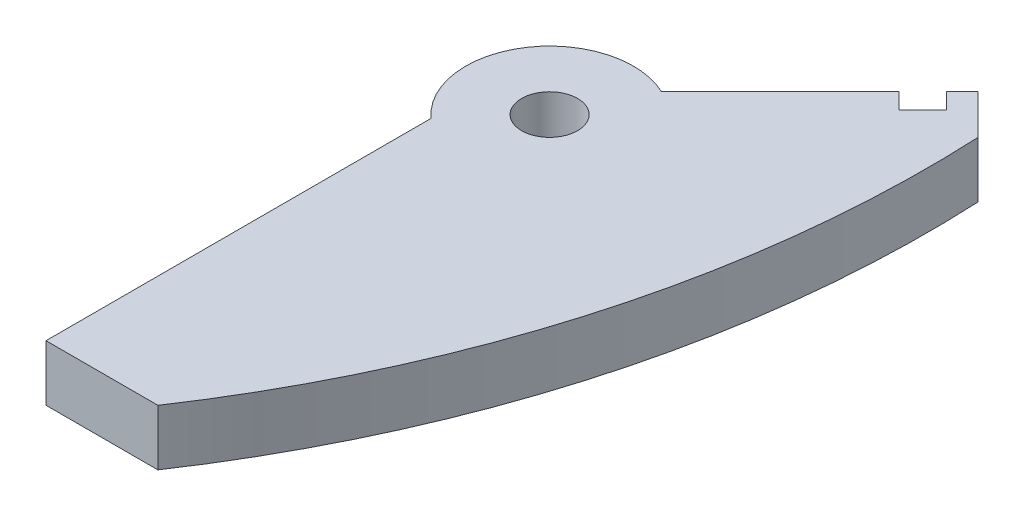
ISO-10303-21;
HEADER;
FILE_DESCRIPTION(('STEP AP214'),'2;1');
FILE_NAME('part.step','',(''),(''),'','','');
FILE_SCHEMA(('AUTOMOTIVE_DESIGN { 1 0 10303 214 1 1 1 1 }'));
ENDSEC;
DATA;
#1=APPLICATION_CONTEXT('core data for automotive mechanical design processes');
#2=APPLICATION_PROTOCOL_DEFINITION('international standard','automotive_design',2000,#1);
#3=PRODUCT_CONTEXT('',#1,'mechanical');
#4=PRODUCT('Part','Part','',(#3));
#5=PRODUCT_RELATED_PRODUCT_CATEGORY('part','',(#4));
#6=PRODUCT_DEFINITION_FORMATION('','',#4);
#7=PRODUCT_DEFINITION_CONTEXT('part definition',#1,'design');
#8=PRODUCT_DEFINITION('design','',#6,#7);
#9=PRODUCT_DEFINITION_SHAPE('','',#8);
#10=(LENGTH_UNIT() NAMED_UNIT(*) SI_UNIT(.MILLI.,.METRE.));
#11=(NAMED_UNIT(*) PLANE_ANGLE_UNIT() SI_UNIT($,.RADIAN.));
#12=(NAMED_UNIT(*) SI_UNIT($,.STERADIAN.) SOLID_ANGLE_UNIT());
#13=UNCERTAINTY_MEASURE_WITH_UNIT(LENGTH_MEASURE(1.E-05),#10,'distance_accuracy_value','');
#14=(GEOMETRIC_REPRESENTATION_CONTEXT(3) GLOBAL_UNCERTAINTY_ASSIGNED_CONTEXT((#13)) GLOBAL_UNIT_ASSIGNED_CONTEXT((#10,
#11,#12)) REPRESENTATION_CONTEXT('',''));
#15=CARTESIAN_POINT('',(0.,0.,0.));
#16=DIRECTION('',(0.,0.,1.));
#17=DIRECTION('',(1.,0.,0.));
#18=AXIS2_PLACEMENT_3D('',#15,#16,#17);
#19=CARTESIAN_POINT('',(0.,3.175,50.8));
#20=DIRECTION('',(0.,0.,1.));
#21=DIRECTION('',(1.,0.,0.));
#22=AXIS2_PLACEMENT_3D('',#19,#20,#21);
#23=PLANE('',#22);
#24=DIRECTION('',(-1.,0.,0.));
#25=VECTOR('',#24,1.);
#26=CARTESIAN_POINT('',(0.,-3.175,50.8));
#27=LINE('',#26,#25);
#28=CARTESIAN_POINT('',(6.35000000000001,-3.175,50.8));
#29=VERTEX_POINT('',#28);
#30=CARTESIAN_POINT('',(-6.34999999999999,-3.175,50.8));
#31=VERTEX_POINT('',#30);
#32=EDGE_CURVE('E161',#29,#31,#27,.T.);
#33=ORIENTED_EDGE('',*,*,#32,.F.);
#34=DIRECTION('',(0.,-1.,0.));
#35=VECTOR('',#34,1.);
#36=CARTESIAN_POINT('',(6.35000000000001,3.175,50.8));
#37=LINE('',#36,#35);
#38=CARTESIAN_POINT('',(6.35000000000001,3.175,50.8));
#39=VERTEX_POINT('',#38);
#40=EDGE_CURVE('E11',#39,#29,#37,.T.);
#41=ORIENTED_EDGE('',*,*,#40,.F.);
#42=DIRECTION('',(-1.,0.,0.));
#43=VECTOR('',#42,1.);
#44=CARTESIAN_POINT('',(0.,3.175,50.8));
#45=LINE('',#44,#43);
#46=CARTESIAN_POINT('',(-6.34999999999999,3.175,50.8));
#47=VERTEX_POINT('',#46);
#48=EDGE_CURVE('E198',#39,#47,#45,.T.);
#49=ORIENTED_EDGE('',*,*,#48,.T.);
#50=DIRECTION('',(0.,-1.,0.));
#51=VECTOR('',#50,1.);
#52=CARTESIAN_POINT('',(-6.34999999999999,3.175,50.8));
#53=LINE('',#52,#51);
#54=EDGE_CURVE('E102',#47,#31,#53,.T.);
#55=ORIENTED_EDGE('',*,*,#54,.T.);
#56=EDGE_LOOP('',(#33,#41,#49,#55));
#57=FACE_BOUND('',#56,.T.);
#58=ADVANCED_FACE('F45',(#57),#23,.T.);
#59=CARTESIAN_POINT('',(-93.915629925862,3.175,-16.2378674755811));
#60=DIRECTION('',(0.,-1.,0.));
#61=DIRECTION('',(0.,0.,-1.));
#62=AXIS2_PLACEMENT_3D('',#59,#60,#61);
#63=CYLINDRICAL_SURFACE('',#62,120.612073276698);
#64=CARTESIAN_POINT('',(-93.915629925862,-3.175,-16.2378674755811));
#65=DIRECTION('',(0.,1.,0.));
#66=DIRECTION('',(0.,0.,1.));
#67=AXIS2_PLACEMENT_3D('',#64,#65,#66);
#68=CIRCLE('',#67,120.612073276698);
#69=CARTESIAN_POINT('',(26.5555762724056,-3.175,-22.0654482118709));
#70=VERTEX_POINT('',#69);
#71=EDGE_CURVE('E165',#70,#29,#68,.F.);
#72=ORIENTED_EDGE('',*,*,#71,.F.);
#73=DIRECTION('',(0.,-1.,0.));
#74=VECTOR('',#73,1.);
#75=CARTESIAN_POINT('',(26.5555762724056,3.175,-22.0654482118709));
#76=LINE('',#75,#74);
#77=CARTESIAN_POINT('',(26.5555762724056,3.175,-22.0654482118709));
#78=VERTEX_POINT('',#77);
#79=EDGE_CURVE('E54',#78,#70,#76,.T.);
#80=ORIENTED_EDGE('',*,*,#79,.F.);
#81=CARTESIAN_POINT('',(-93.915629925862,3.175,-16.2378674755811));
#82=DIRECTION('',(0.,1.,0.));
#83=DIRECTION('',(0.,0.,1.));
#84=AXIS2_PLACEMENT_3D('',#81,#82,#83);
#85=CIRCLE('',#84,120.612073276698);
#86=EDGE_CURVE('E242',#78,#39,#85,.F.);
#87=ORIENTED_EDGE('',*,*,#86,.T.);
#88=ORIENTED_EDGE('',*,*,#40,.T.);
#89=EDGE_LOOP('',(#72,#80,#87,#88));
#90=FACE_BOUND('',#89,.T.);
#91=ADVANCED_FACE('F229',(#90),#63,.T.);
#92=CARTESIAN_POINT('',(24.3105122421384,3.175,-24.3105122421381));
#93=DIRECTION('',(0.707106781186551,0.,-0.707106781186544));
#94=DIRECTION('',(-0.707106781186544,0.,-0.707106781186551));
#95=AXIS2_PLACEMENT_3D('',#92,#93,#94);
#96=PLANE('',#95);
#97=DIRECTION('',(0.707106781186544,0.,0.707106781186551));
#98=VECTOR('',#97,1.);
#99=CARTESIAN_POINT('',(24.3105122421384,-3.175,-24.3105122421381));
#100=LINE('',#99,#98);
#101=CARTESIAN_POINT('',(22.065448211871,-3.175,-26.5555762724055));
#102=VERTEX_POINT('',#101);
#103=EDGE_CURVE('E169',#102,#70,#100,.T.);
#104=ORIENTED_EDGE('',*,*,#103,.F.);
#105=DIRECTION('',(0.,-1.,0.));
#106=VECTOR('',#105,1.);
#107=CARTESIAN_POINT('',(22.065448211871,3.175,-26.5555762724055));
#108=LINE('',#107,#106);
#109=CARTESIAN_POINT('',(22.065448211871,3.175,-26.5555762724055));
#110=VERTEX_POINT('',#109);
#111=EDGE_CURVE('E216',#110,#102,#108,.T.);
#112=ORIENTED_EDGE('',*,*,#111,.F.);
#113=DIRECTION('',(0.707106781186544,0.,0.707106781186551));
#114=VECTOR('',#113,1.);
#115=CARTESIAN_POINT('',(24.3105122421384,3.175,-24.3105122421381));
#116=LINE('',#115,#114);
#117=EDGE_CURVE('E225',#110,#78,#116,.T.);
#118=ORIENTED_EDGE('',*,*,#117,.T.);
#119=ORIENTED_EDGE('',*,*,#79,.T.);
#120=EDGE_LOOP('',(#104,#112,#118,#119));
#121=FACE_BOUND('',#120,.T.);
#122=ADVANCED_FACE('F223',(#121),#96,.T.);
#123=CARTESIAN_POINT('',(-2.2450640302668,3.175,-2.24506403026671));
#124=DIRECTION('',(-0.707106781186562,0.,-0.707106781186533));
#125=DIRECTION('',(-0.707106781186533,0.,0.707106781186562));
#126=AXIS2_PLACEMENT_3D('',#123,#124,#125);
#127=PLANE('',#126);
#128=DIRECTION('',(0.707106781186533,0.,-0.707106781186562));
#129=VECTOR('',#128,1.);
#130=CARTESIAN_POINT('',(-2.2450640302668,-3.175,-2.24506403026671));
#131=LINE('',#130,#129);
#132=CARTESIAN_POINT('',(20.2693969876573,-3.175,-24.7595250481917));
#133=VERTEX_POINT('',#132);
#134=EDGE_CURVE('E173',#133,#102,#131,.T.);
#135=ORIENTED_EDGE('',*,*,#134,.F.);
#136=DIRECTION('',(0.,-1.,0.));
#137=VECTOR('',#136,1.);
#138=CARTESIAN_POINT('',(20.2693969876573,3.175,-24.7595250481917));
#139=LINE('',#138,#137);
#140=CARTESIAN_POINT('',(20.2693969876573,3.175,-24.7595250481917));
#141=VERTEX_POINT('',#140);
#142=EDGE_CURVE('E213',#141,#133,#139,.T.);
#143=ORIENTED_EDGE('',*,*,#142,.F.);
#144=DIRECTION('',(0.707106781186533,0.,-0.707106781186562));
#145=VECTOR('',#144,1.);
#146=CARTESIAN_POINT('',(-2.2450640302668,3.175,-2.24506403026671));
#147=LINE('',#146,#145);
#148=EDGE_CURVE('E241',#141,#110,#147,.T.);
#149=ORIENTED_EDGE('',*,*,#148,.T.);
#150=ORIENTED_EDGE('',*,*,#111,.T.);
#151=EDGE_LOOP('',(#135,#143,#149,#150));
#152=FACE_BOUND('',#151,.T.);
#153=ADVANCED_FACE('F237',(#152),#127,.T.);
#154=CARTESIAN_POINT('',(22.5144610179246,3.175,-22.5144610179243));
#155=DIRECTION('',(0.707106781186552,0.,-0.707106781186543));
#156=DIRECTION('',(-0.707106781186543,0.,-0.707106781186552));
#157=AXIS2_PLACEMENT_3D('',#154,#155,#156);
#158=PLANE('',#157);
#159=DIRECTION('',(0.707106781186543,0.,0.707106781186552));
#160=VECTOR('',#159,1.);
#161=CARTESIAN_POINT('',(22.5144610179246,-3.175,-22.5144610179243));
#162=LINE('',#161,#160);
#163=CARTESIAN_POINT('',(22.0654482118711,-3.175,-22.9634738239778));
#164=VERTEX_POINT('',#163);
#165=EDGE_CURVE('E177',#133,#164,#162,.T.);
#166=ORIENTED_EDGE('',*,*,#165,.T.);
#167=DIRECTION('',(0.,-1.,0.));
#168=VECTOR('',#167,1.);
#169=CARTESIAN_POINT('',(22.0654482118711,3.175,-22.9634738239778));
#170=LINE('',#169,#168);
#171=CARTESIAN_POINT('',(22.0654482118711,3.175,-22.9634738239778));
#172=VERTEX_POINT('',#171);
#173=EDGE_CURVE('E209',#172,#164,#170,.T.);
#174=ORIENTED_EDGE('',*,*,#173,.F.);
#175=DIRECTION('',(0.707106781186543,0.,0.707106781186552));
#176=VECTOR('',#175,1.);
#177=CARTESIAN_POINT('',(22.5144610179246,3.175,-22.5144610179243));
#178=LINE('',#177,#176);
#179=EDGE_CURVE('E247',#141,#172,#178,.T.);
#180=ORIENTED_EDGE('',*,*,#179,.F.);
#181=ORIENTED_EDGE('',*,*,#142,.T.);
#182=EDGE_LOOP('',(#166,#174,#180,#181));
#183=FACE_BOUND('',#182,.T.);
#184=ADVANCED_FACE('F277',(#183),#158,.F.);
#185=CARTESIAN_POINT('',(-0.449012806053497,3.175,-0.449012806053502));
#186=DIRECTION('',(0.707106781186544,0.,0.707106781186551));
#187=DIRECTION('',(0.707106781186551,0.,-0.707106781186544));
#188=AXIS2_PLACEMENT_3D('',#185,#186,#187);
#189=PLANE('',#188);
#190=DIRECTION('',(-0.707106781186551,0.,0.707106781186544));
#191=VECTOR('',#190,1.);
#192=CARTESIAN_POINT('',(-0.449012806053497,-3.175,-0.449012806053502));
#193=LINE('',#192,#191);
#194=CARTESIAN_POINT('',(19.3713713755503,-3.175,-20.2693969876571));
#195=VERTEX_POINT('',#194);
#196=EDGE_CURVE('E180',#164,#195,#193,.T.);
#197=ORIENTED_EDGE('',*,*,#196,.T.);
#198=DIRECTION('',(0.,-1.,0.));
#199=VECTOR('',#198,1.);
#200=CARTESIAN_POINT('',(19.3713713755503,3.175,-20.2693969876571));
#201=LINE('',#200,#199);
#202=CARTESIAN_POINT('',(19.3713713755503,3.175,-20.2693969876571));
#203=VERTEX_POINT('',#202);
#204=EDGE_CURVE('E205',#203,#195,#201,.T.);
#205=ORIENTED_EDGE('',*,*,#204,.F.);
#206=DIRECTION('',(-0.707106781186551,0.,0.707106781186544));
#207=VECTOR('',#206,1.);
#208=CARTESIAN_POINT('',(-0.449012806053497,3.175,-0.449012806053502));
#209=LINE('',#208,#207);
#210=EDGE_CURVE('E151',#172,#203,#209,.T.);
#211=ORIENTED_EDGE('',*,*,#210,.F.);
#212=ORIENTED_EDGE('',*,*,#173,.T.);
#213=EDGE_LOOP('',(#197,#205,#211,#212));
#214=FACE_BOUND('',#213,.T.);
#215=ADVANCED_FACE('F258',(#214),#189,.F.);
#216=CARTESIAN_POINT('',(19.8203841816038,3.175,-19.8203841816036));
#217=DIRECTION('',(-0.707106781186552,0.,0.707106781186543));
#218=DIRECTION('',(0.707106781186543,0.,0.707106781186552));
#219=AXIS2_PLACEMENT_3D('',#216,#217,#218);
#220=PLANE('',#219);
#221=DIRECTION('',(-0.707106781186544,0.,-0.707106781186552));
#222=VECTOR('',#221,1.);
#223=CARTESIAN_POINT('',(19.8203841816038,-3.175,-19.8203841816036));
#224=LINE('',#223,#222);
#225=CARTESIAN_POINT('',(17.5753201513365,-3.175,-22.0654482118709));
#226=VERTEX_POINT('',#225);
#227=EDGE_CURVE('E183',#195,#226,#224,.T.);
#228=ORIENTED_EDGE('',*,*,#227,.T.);
#229=DIRECTION('',(0.,-1.,0.));
#230=VECTOR('',#229,1.);
#231=CARTESIAN_POINT('',(17.5753201513365,3.175,-22.0654482118709));
#232=LINE('',#231,#230);
#233=CARTESIAN_POINT('',(17.5753201513365,3.175,-22.0654482118709));
#234=VERTEX_POINT('',#233);
#235=EDGE_CURVE('E136',#234,#226,#232,.T.);
#236=ORIENTED_EDGE('',*,*,#235,.F.);
#237=DIRECTION('',(-0.707106781186544,0.,-0.707106781186552));
#238=VECTOR('',#237,1.);
#239=CARTESIAN_POINT('',(19.8203841816038,3.175,-19.8203841816036));
#240=LINE('',#239,#238);
#241=EDGE_CURVE('E146',#203,#234,#240,.T.);
#242=ORIENTED_EDGE('',*,*,#241,.F.);
#243=ORIENTED_EDGE('',*,*,#204,.T.);
#244=EDGE_LOOP('',(#228,#236,#242,#243));
#245=FACE_BOUND('',#244,.T.);
#246=ADVANCED_FACE('F261',(#245),#220,.F.);
#247=CARTESIAN_POINT('',(-2.24506403026737,3.175,-2.24506403026741));
#248=DIRECTION('',(-0.707106781186542,0.,-0.707106781186553));
#249=DIRECTION('',(-0.707106781186553,0.,0.707106781186542));
#250=AXIS2_PLACEMENT_3D('',#247,#248,#249);
#251=PLANE('',#250);
#252=DIRECTION('',(0.707106781186553,0.,-0.707106781186542));
#253=VECTOR('',#252,1.);
#254=CARTESIAN_POINT('',(-2.24506403026737,-3.175,-2.24506403026741));
#255=LINE('',#254,#253);
#256=CARTESIAN_POINT('',(4.10493596973264,-3.175,-8.59506403026733));
#257=VERTEX_POINT('',#256);
#258=EDGE_CURVE('E134',#257,#226,#255,.T.);
#259=ORIENTED_EDGE('',*,*,#258,.F.);
#260=DIRECTION('',(0.,-1.,0.));
#261=VECTOR('',#260,1.);
#262=CARTESIAN_POINT('',(4.10493596973264,3.175,-8.59506403026733));
#263=LINE('',#262,#261);
#264=CARTESIAN_POINT('',(4.10493596973264,3.175,-8.59506403026733));
#265=VERTEX_POINT('',#264);
#266=EDGE_CURVE('E128',#265,#257,#263,.T.);
#267=ORIENTED_EDGE('',*,*,#266,.F.);
#268=DIRECTION('',(0.707106781186553,0.,-0.707106781186542));
#269=VECTOR('',#268,1.);
#270=CARTESIAN_POINT('',(-2.24506403026737,3.175,-2.24506403026741));
#271=LINE('',#270,#269);
#272=EDGE_CURVE('E132',#265,#234,#271,.T.);
#273=ORIENTED_EDGE('',*,*,#272,.T.);
#274=ORIENTED_EDGE('',*,*,#235,.T.);
#275=EDGE_LOOP('',(#259,#267,#273,#274));
#276=FACE_BOUND('',#275,.T.);
#277=ADVANCED_FACE('F130',(#276),#251,.T.);
#278=CARTESIAN_POINT('',(0.,3.175,0.));
#279=DIRECTION('',(0.,-1.,0.));
#280=DIRECTION('',(0.,0.,-1.));
#281=AXIS2_PLACEMENT_3D('',#278,#279,#280);
#282=CYLINDRICAL_SURFACE('',#281,9.525);
#283=CARTESIAN_POINT('',(0.,-3.175,0.));
#284=DIRECTION('',(0.,1.,0.));
#285=DIRECTION('',(0.,0.,1.));
#286=AXIS2_PLACEMENT_3D('',#283,#284,#285);
#287=CIRCLE('',#286,9.525);
#288=CARTESIAN_POINT('',(-6.35,-3.175,7.09951582856183));
#289=VERTEX_POINT('',#288);
#290=EDGE_CURVE('E95',#257,#289,#287,.T.);
#291=ORIENTED_EDGE('',*,*,#290,.T.);
#292=DIRECTION('',(0.,-1.,0.));
#293=VECTOR('',#292,1.);
#294=CARTESIAN_POINT('',(-6.35,3.175,7.09951582856183));
#295=LINE('',#294,#293);
#296=CARTESIAN_POINT('',(-6.35,3.175,7.09951582856183));
#297=VERTEX_POINT('',#296);
#298=EDGE_CURVE('E137',#297,#289,#295,.T.);
#299=ORIENTED_EDGE('',*,*,#298,.F.);
#300=CARTESIAN_POINT('',(0.,3.175,0.));
#301=DIRECTION('',(0.,1.,0.));
#302=DIRECTION('',(0.,0.,1.));
#303=AXIS2_PLACEMENT_3D('',#300,#301,#302);
#304=CIRCLE('',#303,9.525);
#305=EDGE_CURVE('E139',#265,#297,#304,.T.);
#306=ORIENTED_EDGE('',*,*,#305,.F.);
#307=ORIENTED_EDGE('',*,*,#266,.T.);
#308=EDGE_LOOP('',(#291,#299,#306,#307));
#309=FACE_BOUND('',#308,.T.);
#310=ADVANCED_FACE('F140',(#309),#282,.T.);
#311=CARTESIAN_POINT('',(-6.35,3.175,0.));
#312=DIRECTION('',(1.,0.,0.));
#313=DIRECTION('',(0.,0.,-1.));
#314=AXIS2_PLACEMENT_3D('',#311,#312,#313);
#315=PLANE('',#314);
#316=DIRECTION('',(0.,0.,1.));
#317=VECTOR('',#316,1.);
#318=CARTESIAN_POINT('',(-6.35,-3.175,0.));
#319=LINE('',#318,#317);
#320=EDGE_CURVE('E191',#289,#31,#319,.T.);
#321=ORIENTED_EDGE('',*,*,#320,.T.);
#322=ORIENTED_EDGE('',*,*,#54,.F.);
#323=DIRECTION('',(0.,0.,1.));
#324=VECTOR('',#323,1.);
#325=CARTESIAN_POINT('',(-6.35,3.175,0.));
#326=LINE('',#325,#324);
#327=EDGE_CURVE('E62',#297,#47,#326,.T.);
#328=ORIENTED_EDGE('',*,*,#327,.F.);
#329=ORIENTED_EDGE('',*,*,#298,.T.);
#330=EDGE_LOOP('',(#321,#322,#328,#329));
#331=FACE_BOUND('',#330,.T.);
#332=ADVANCED_FACE('F264',(#331),#315,.F.);
#333=CARTESIAN_POINT('',(0.,3.175,0.));
#334=DIRECTION('',(0.,-1.,0.));
#335=DIRECTION('',(0.,0.,-1.));
#336=AXIS2_PLACEMENT_3D('',#333,#334,#335);
#337=CYLINDRICAL_SURFACE('',#336,3.175);
#338=CARTESIAN_POINT('',(0.,3.175,0.));
#339=DIRECTION('',(0.,1.,0.));
#340=DIRECTION('',(0.,0.,1.));
#341=AXIS2_PLACEMENT_3D('',#338,#339,#340);
#342=CIRCLE('',#341,3.175);
#343=CARTESIAN_POINT('',(0.,3.175,3.175));
#344=VERTEX_POINT('',#343);
#345=EDGE_CURVE('E157',#344,#344,#342,.T.);
#346=ORIENTED_EDGE('',*,*,#345,.T.);
#347=EDGE_LOOP('',(#346));
#348=FACE_BOUND('',#347,.T.);
#349=CARTESIAN_POINT('',(0.,-3.175,0.));
#350=DIRECTION('',(0.,1.,0.));
#351=DIRECTION('',(0.,0.,1.));
#352=AXIS2_PLACEMENT_3D('',#349,#350,#351);
#353=CIRCLE('',#352,3.175);
#354=CARTESIAN_POINT('',(0.,-3.175,3.175));
#355=VERTEX_POINT('',#354);
#356=EDGE_CURVE('E194',#355,#355,#353,.T.);
#357=ORIENTED_EDGE('',*,*,#356,.F.);
#358=EDGE_LOOP('',(#357));
#359=FACE_BOUND('',#358,.T.);
#360=ADVANCED_FACE('F291',(#348,#359),#337,.F.);
#361=CARTESIAN_POINT('',(0.,3.175,0.));
#362=DIRECTION('',(0.,1.,0.));
#363=DIRECTION('',(0.,0.,1.));
#364=AXIS2_PLACEMENT_3D('',#361,#362,#363);
#365=PLANE('',#364);
#366=ORIENTED_EDGE('',*,*,#48,.F.);
#367=ORIENTED_EDGE('',*,*,#86,.F.);
#368=ORIENTED_EDGE('',*,*,#117,.F.);
#369=ORIENTED_EDGE('',*,*,#148,.F.);
#370=ORIENTED_EDGE('',*,*,#179,.T.);
#371=ORIENTED_EDGE('',*,*,#210,.T.);
#372=ORIENTED_EDGE('',*,*,#241,.T.);
#373=ORIENTED_EDGE('',*,*,#272,.F.);
#374=ORIENTED_EDGE('',*,*,#305,.T.);
#375=ORIENTED_EDGE('',*,*,#327,.T.);
#376=EDGE_LOOP('',(#366,#367,#368,#369,#370,#371,#372,#373,#374,#375));
#377=FACE_BOUND('',#376,.T.);
#378=ORIENTED_EDGE('',*,*,#345,.F.);
#379=EDGE_LOOP('',(#378));
#380=FACE_BOUND('',#379,.T.);
#381=ADVANCED_FACE('F143',(#377,#380),#365,.T.);
#382=CARTESIAN_POINT('',(0.,-3.175,0.));
#383=DIRECTION('',(0.,1.,0.));
#384=DIRECTION('',(0.,0.,1.));
#385=AXIS2_PLACEMENT_3D('',#382,#383,#384);
#386=PLANE('',#385);
#387=ORIENTED_EDGE('',*,*,#32,.T.);
#388=ORIENTED_EDGE('',*,*,#320,.F.);
#389=ORIENTED_EDGE('',*,*,#290,.F.);
#390=ORIENTED_EDGE('',*,*,#258,.T.);
#391=ORIENTED_EDGE('',*,*,#227,.F.);
#392=ORIENTED_EDGE('',*,*,#196,.F.);
#393=ORIENTED_EDGE('',*,*,#165,.F.);
#394=ORIENTED_EDGE('',*,*,#134,.T.);
#395=ORIENTED_EDGE('',*,*,#103,.T.);
#396=ORIENTED_EDGE('',*,*,#71,.T.);
#397=EDGE_LOOP('',(#387,#388,#389,#390,#391,#392,#393,#394,#395,#396));
#398=FACE_BOUND('',#397,.T.);
#399=ORIENTED_EDGE('',*,*,#356,.T.);
#400=EDGE_LOOP('',(#399));
#401=FACE_BOUND('',#400,.T.);
#402=ADVANCED_FACE('F231',(#398,#401),#386,.F.);
#403=CLOSED_SHELL('',(#58,#91,#122,#153,#184,#215,#246,#277,#310,#332,#360,#381,#402));
#404=MANIFOLD_SOLID_BREP('B2',#403);
#405=ADVANCED_BREP_SHAPE_REPRESENTATION('',(#18,#404),#14);
#406=SHAPE_DEFINITION_REPRESENTATION(#9,#405);
ENDSEC;
END-ISO-10303-21;
